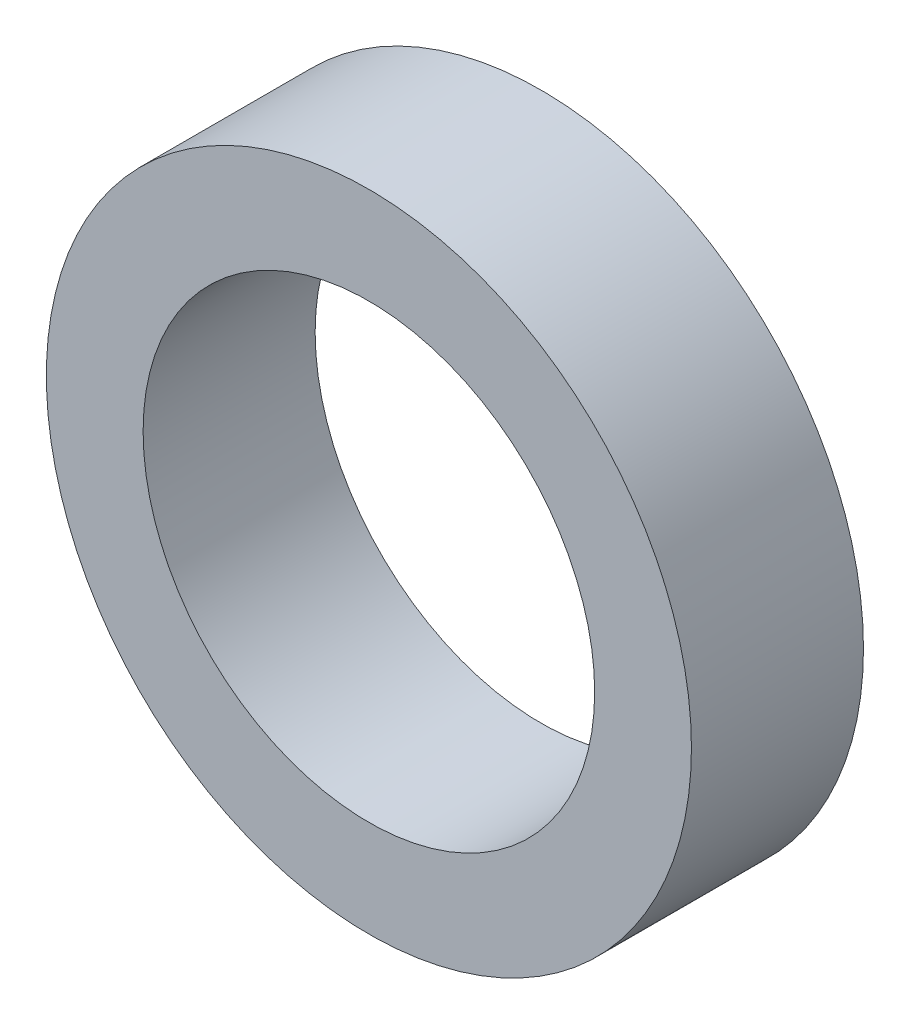
ISO-10303-21;
HEADER;
FILE_DESCRIPTION(('STEP AP214'),'2;1');
FILE_NAME('part.step','',(''),(''),'','','');
FILE_SCHEMA(('AUTOMOTIVE_DESIGN { 1 0 10303 214 1 1 1 1 }'));
ENDSEC;
DATA;
#1=APPLICATION_CONTEXT('core data for automotive mechanical design processes');
#2=APPLICATION_PROTOCOL_DEFINITION('international standard','automotive_design',2000,#1);
#3=PRODUCT_CONTEXT('',#1,'mechanical');
#4=PRODUCT('Part','Part','',(#3));
#5=PRODUCT_RELATED_PRODUCT_CATEGORY('part','',(#4));
#6=PRODUCT_DEFINITION_FORMATION('','',#4);
#7=PRODUCT_DEFINITION_CONTEXT('part definition',#1,'design');
#8=PRODUCT_DEFINITION('design','',#6,#7);
#9=PRODUCT_DEFINITION_SHAPE('','',#8);
#10=(LENGTH_UNIT() NAMED_UNIT(*) SI_UNIT(.MILLI.,.METRE.));
#11=(NAMED_UNIT(*) PLANE_ANGLE_UNIT() SI_UNIT($,.RADIAN.));
#12=(NAMED_UNIT(*) SI_UNIT($,.STERADIAN.) SOLID_ANGLE_UNIT());
#13=UNCERTAINTY_MEASURE_WITH_UNIT(LENGTH_MEASURE(1.E-05),#10,'distance_accuracy_value','');
#14=(GEOMETRIC_REPRESENTATION_CONTEXT(3) GLOBAL_UNCERTAINTY_ASSIGNED_CONTEXT((#13)) GLOBAL_UNIT_ASSIGNED_CONTEXT((#10,
#11,#12)) REPRESENTATION_CONTEXT('',''));
#15=CARTESIAN_POINT('',(0.,0.,0.));
#16=DIRECTION('',(0.,0.,1.));
#17=DIRECTION('',(1.,0.,0.));
#18=AXIS2_PLACEMENT_3D('',#15,#16,#17);
#19=CARTESIAN_POINT('',(0.,0.,1.6));
#20=DIRECTION('',(0.,0.,1.));
#21=DIRECTION('',(1.,0.,0.));
#22=AXIS2_PLACEMENT_3D('',#19,#20,#21);
#23=PLANE('',#22);
#24=CARTESIAN_POINT('',(0.,0.,1.6));
#25=DIRECTION('',(0.,0.,1.));
#26=DIRECTION('',(1.,0.,0.));
#27=AXIS2_PLACEMENT_3D('',#24,#25,#26);
#28=CIRCLE('',#27,3.);
#29=CARTESIAN_POINT('',(3.,0.,1.6));
#30=VERTEX_POINT('',#29);
#31=EDGE_CURVE('E10',#30,#30,#28,.T.);
#32=ORIENTED_EDGE('',*,*,#31,.T.);
#33=EDGE_LOOP('',(#32));
#34=FACE_BOUND('',#33,.T.);
#35=CARTESIAN_POINT('',(0.,0.,1.6));
#36=DIRECTION('',(0.,0.,1.));
#37=DIRECTION('',(1.,0.,0.));
#38=AXIS2_PLACEMENT_3D('',#35,#36,#37);
#39=CIRCLE('',#38,2.1);
#40=CARTESIAN_POINT('',(2.1,0.,1.6));
#41=VERTEX_POINT('',#40);
#42=EDGE_CURVE('E50',#41,#41,#39,.T.);
#43=ORIENTED_EDGE('',*,*,#42,.F.);
#44=EDGE_LOOP('',(#43));
#45=FACE_BOUND('',#44,.T.);
#46=ADVANCED_FACE('F37',(#34,#45),#23,.T.);
#47=CARTESIAN_POINT('',(0.,0.,0.));
#48=DIRECTION('',(0.,0.,1.));
#49=DIRECTION('',(1.,0.,0.));
#50=AXIS2_PLACEMENT_3D('',#47,#48,#49);
#51=PLANE('',#50);
#52=CARTESIAN_POINT('',(0.,0.,0.));
#53=DIRECTION('',(0.,0.,1.));
#54=DIRECTION('',(1.,0.,0.));
#55=AXIS2_PLACEMENT_3D('',#52,#53,#54);
#56=CIRCLE('',#55,3.);
#57=CARTESIAN_POINT('',(3.,0.,0.));
#58=VERTEX_POINT('',#57);
#59=EDGE_CURVE('E41',#58,#58,#56,.T.);
#60=ORIENTED_EDGE('',*,*,#59,.F.);
#61=EDGE_LOOP('',(#60));
#62=FACE_BOUND('',#61,.T.);
#63=CARTESIAN_POINT('',(0.,0.,0.));
#64=DIRECTION('',(0.,0.,1.));
#65=DIRECTION('',(1.,0.,0.));
#66=AXIS2_PLACEMENT_3D('',#63,#64,#65);
#67=CIRCLE('',#66,2.1);
#68=CARTESIAN_POINT('',(2.1,0.,0.));
#69=VERTEX_POINT('',#68);
#70=EDGE_CURVE('E52',#69,#69,#67,.T.);
#71=ORIENTED_EDGE('',*,*,#70,.T.);
#72=EDGE_LOOP('',(#71));
#73=FACE_BOUND('',#72,.T.);
#74=ADVANCED_FACE('F64',(#62,#73),#51,.F.);
#75=CARTESIAN_POINT('',(0.,0.,1.6));
#76=DIRECTION('',(0.,0.,-1.));
#77=DIRECTION('',(-1.,0.,0.));
#78=AXIS2_PLACEMENT_3D('',#75,#76,#77);
#79=CYLINDRICAL_SURFACE('',#78,3.);
#80=ORIENTED_EDGE('',*,*,#31,.F.);
#81=EDGE_LOOP('',(#80));
#82=FACE_BOUND('',#81,.T.);
#83=ORIENTED_EDGE('',*,*,#59,.T.);
#84=EDGE_LOOP('',(#83));
#85=FACE_BOUND('',#84,.T.);
#86=ADVANCED_FACE('F39',(#82,#85),#79,.T.);
#87=CARTESIAN_POINT('',(0.,0.,1.6));
#88=DIRECTION('',(0.,0.,-1.));
#89=DIRECTION('',(-1.,0.,0.));
#90=AXIS2_PLACEMENT_3D('',#87,#88,#89);
#91=CYLINDRICAL_SURFACE('',#90,2.1);
#92=ORIENTED_EDGE('',*,*,#42,.T.);
#93=EDGE_LOOP('',(#92));
#94=FACE_BOUND('',#93,.T.);
#95=ORIENTED_EDGE('',*,*,#70,.F.);
#96=EDGE_LOOP('',(#95));
#97=FACE_BOUND('',#96,.T.);
#98=ADVANCED_FACE('F60',(#94,#97),#91,.F.);
#99=CLOSED_SHELL('',(#46,#74,#86,#98));
#100=MANIFOLD_SOLID_BREP('B2',#99);
#101=ADVANCED_BREP_SHAPE_REPRESENTATION('',(#18,#100),#14);
#102=SHAPE_DEFINITION_REPRESENTATION(#9,#101);
ENDSEC;
END-ISO-10303-21;
